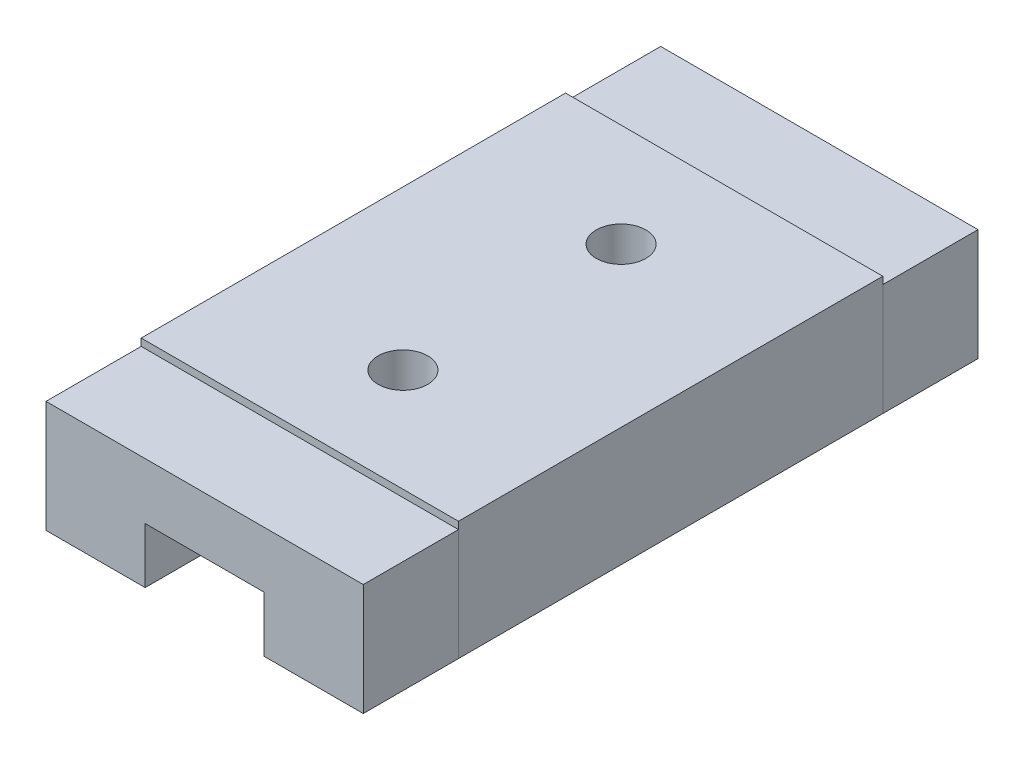
ISO-10303-21;
HEADER;
FILE_DESCRIPTION(('STEP AP214'),'2;1');
FILE_NAME('part.step','',(''),(''),'','','');
FILE_SCHEMA(('AUTOMOTIVE_DESIGN { 1 0 10303 214 1 1 1 1 }'));
ENDSEC;
DATA;
#1=APPLICATION_CONTEXT('core data for automotive mechanical design processes');
#2=APPLICATION_PROTOCOL_DEFINITION('international standard','automotive_design',2000,#1);
#3=PRODUCT_CONTEXT('',#1,'mechanical');
#4=PRODUCT('Part','Part','',(#3));
#5=PRODUCT_RELATED_PRODUCT_CATEGORY('part','',(#4));
#6=PRODUCT_DEFINITION_FORMATION('','',#4);
#7=PRODUCT_DEFINITION_CONTEXT('part definition',#1,'design');
#8=PRODUCT_DEFINITION('design','',#6,#7);
#9=PRODUCT_DEFINITION_SHAPE('','',#8);
#10=(LENGTH_UNIT() NAMED_UNIT(*) SI_UNIT(.MILLI.,.METRE.));
#11=(NAMED_UNIT(*) PLANE_ANGLE_UNIT() SI_UNIT($,.RADIAN.));
#12=(NAMED_UNIT(*) SI_UNIT($,.STERADIAN.) SOLID_ANGLE_UNIT());
#13=UNCERTAINTY_MEASURE_WITH_UNIT(LENGTH_MEASURE(1.E-05),#10,'distance_accuracy_value','');
#14=(GEOMETRIC_REPRESENTATION_CONTEXT(3) GLOBAL_UNCERTAINTY_ASSIGNED_CONTEXT((#13)) GLOBAL_UNIT_ASSIGNED_CONTEXT((#10,
#11,#12)) REPRESENTATION_CONTEXT('',''));
#15=CARTESIAN_POINT('',(0.,0.,0.));
#16=DIRECTION('',(0.,0.,1.));
#17=DIRECTION('',(1.,0.,0.));
#18=AXIS2_PLACEMENT_3D('',#15,#16,#17);
#19=CARTESIAN_POINT('',(-4.,-1.5,13.1));
#20=DIRECTION('',(1.,0.,0.));
#21=DIRECTION('',(0.,1.,0.));
#22=AXIS2_PLACEMENT_3D('',#19,#20,#21);
#23=PLANE('',#22);
#24=DIRECTION('',(0.,-1.,0.));
#25=VECTOR('',#24,1.);
#26=CARTESIAN_POINT('',(-4.,-1.5,10.7));
#27=LINE('',#26,#25);
#28=CARTESIAN_POINT('',(-4.,1.31787640624204,10.7));
#29=VERTEX_POINT('',#28);
#30=CARTESIAN_POINT('',(-4.,-1.5,10.7));
#31=VERTEX_POINT('',#30);
#32=EDGE_CURVE('E150',#29,#31,#27,.T.);
#33=ORIENTED_EDGE('',*,*,#32,.T.);
#34=DIRECTION('',(0.,0.,-1.));
#35=VECTOR('',#34,1.);
#36=CARTESIAN_POINT('',(-4.,-1.5,13.1));
#37=LINE('',#36,#35);
#38=CARTESIAN_POINT('',(-4.,-1.5,13.1));
#39=VERTEX_POINT('',#38);
#40=EDGE_CURVE('E12',#39,#31,#37,.T.);
#41=ORIENTED_EDGE('',*,*,#40,.F.);
#42=DIRECTION('',(0.,-1.,0.));
#43=VECTOR('',#42,1.);
#44=CARTESIAN_POINT('',(-4.,-1.5,13.1));
#45=LINE('',#44,#43);
#46=CARTESIAN_POINT('',(-4.,1.31787640624204,13.1));
#47=VERTEX_POINT('',#46);
#48=EDGE_CURVE('E164',#47,#39,#45,.T.);
#49=ORIENTED_EDGE('',*,*,#48,.F.);
#50=DIRECTION('',(0.,0.,-1.));
#51=VECTOR('',#50,1.);
#52=CARTESIAN_POINT('',(-4.,1.31787640624204,13.1));
#53=LINE('',#52,#51);
#54=EDGE_CURVE('E146',#47,#29,#53,.T.);
#55=ORIENTED_EDGE('',*,*,#54,.T.);
#56=EDGE_LOOP('',(#33,#41,#49,#55));
#57=FACE_BOUND('',#56,.T.);
#58=ADVANCED_FACE('F54',(#57),#23,.F.);
#59=CARTESIAN_POINT('',(-1.5,-1.5,13.1));
#60=DIRECTION('',(0.,1.,0.));
#61=DIRECTION('',(0.,0.,1.));
#62=AXIS2_PLACEMENT_3D('',#59,#60,#61);
#63=PLANE('',#62);
#64=DIRECTION('',(1.,0.,0.));
#65=VECTOR('',#64,1.);
#66=CARTESIAN_POINT('',(-1.5,-1.5,10.7));
#67=LINE('',#66,#65);
#68=CARTESIAN_POINT('',(-1.5,-1.5,10.7));
#69=VERTEX_POINT('',#68);
#70=EDGE_CURVE('E153',#31,#69,#67,.T.);
#71=ORIENTED_EDGE('',*,*,#70,.T.);
#72=DIRECTION('',(0.,0.,-1.));
#73=VECTOR('',#72,1.);
#74=CARTESIAN_POINT('',(-1.5,-1.5,13.1));
#75=LINE('',#74,#73);
#76=CARTESIAN_POINT('',(-1.5,-1.5,13.1));
#77=VERTEX_POINT('',#76);
#78=EDGE_CURVE('E62',#77,#69,#75,.T.);
#79=ORIENTED_EDGE('',*,*,#78,.F.);
#80=DIRECTION('',(1.,0.,0.));
#81=VECTOR('',#80,1.);
#82=CARTESIAN_POINT('',(-1.5,-1.5,13.1));
#83=LINE('',#82,#81);
#84=EDGE_CURVE('E113',#39,#77,#83,.T.);
#85=ORIENTED_EDGE('',*,*,#84,.F.);
#86=ORIENTED_EDGE('',*,*,#40,.T.);
#87=EDGE_LOOP('',(#71,#79,#85,#86));
#88=FACE_BOUND('',#87,.T.);
#89=ADVANCED_FACE('F199',(#88),#63,.F.);
#90=CARTESIAN_POINT('',(-1.5,-0.1,13.1));
#91=DIRECTION('',(-1.,0.,0.));
#92=DIRECTION('',(0.,0.,1.));
#93=AXIS2_PLACEMENT_3D('',#90,#91,#92);
#94=PLANE('',#93);
#95=DIRECTION('',(0.,1.,0.));
#96=VECTOR('',#95,1.);
#97=CARTESIAN_POINT('',(-1.5,-0.1,10.7));
#98=LINE('',#97,#96);
#99=CARTESIAN_POINT('',(-1.5,-0.1,10.7));
#100=VERTEX_POINT('',#99);
#101=EDGE_CURVE('E155',#69,#100,#98,.T.);
#102=ORIENTED_EDGE('',*,*,#101,.T.);
#103=DIRECTION('',(0.,0.,-1.));
#104=VECTOR('',#103,1.);
#105=CARTESIAN_POINT('',(-1.5,-0.1,13.1));
#106=LINE('',#105,#104);
#107=CARTESIAN_POINT('',(-1.5,-0.1,13.1));
#108=VERTEX_POINT('',#107);
#109=EDGE_CURVE('E171',#108,#100,#106,.T.);
#110=ORIENTED_EDGE('',*,*,#109,.F.);
#111=DIRECTION('',(0.,1.,0.));
#112=VECTOR('',#111,1.);
#113=CARTESIAN_POINT('',(-1.5,-0.1,13.1));
#114=LINE('',#113,#112);
#115=EDGE_CURVE('E179',#77,#108,#114,.T.);
#116=ORIENTED_EDGE('',*,*,#115,.F.);
#117=ORIENTED_EDGE('',*,*,#78,.T.);
#118=EDGE_LOOP('',(#102,#110,#116,#117));
#119=FACE_BOUND('',#118,.T.);
#120=ADVANCED_FACE('F177',(#119),#94,.F.);
#121=CARTESIAN_POINT('',(1.5,-0.1,13.1));
#122=DIRECTION('',(0.,1.,0.));
#123=DIRECTION('',(0.,0.,1.));
#124=AXIS2_PLACEMENT_3D('',#121,#122,#123);
#125=PLANE('',#124);
#126=DIRECTION('',(1.,0.,0.));
#127=VECTOR('',#126,1.);
#128=CARTESIAN_POINT('',(1.5,-0.1,10.7));
#129=LINE('',#128,#127);
#130=CARTESIAN_POINT('',(1.5,-0.1,10.7));
#131=VERTEX_POINT('',#130);
#132=EDGE_CURVE('E157',#100,#131,#129,.T.);
#133=ORIENTED_EDGE('',*,*,#132,.T.);
#134=DIRECTION('',(0.,0.,-1.));
#135=VECTOR('',#134,1.);
#136=CARTESIAN_POINT('',(1.5,-0.1,13.1));
#137=LINE('',#136,#135);
#138=CARTESIAN_POINT('',(1.5,-0.1,13.1));
#139=VERTEX_POINT('',#138);
#140=EDGE_CURVE('E168',#139,#131,#137,.T.);
#141=ORIENTED_EDGE('',*,*,#140,.F.);
#142=DIRECTION('',(1.,0.,0.));
#143=VECTOR('',#142,1.);
#144=CARTESIAN_POINT('',(1.5,-0.1,13.1));
#145=LINE('',#144,#143);
#146=EDGE_CURVE('E191',#108,#139,#145,.T.);
#147=ORIENTED_EDGE('',*,*,#146,.F.);
#148=ORIENTED_EDGE('',*,*,#109,.T.);
#149=EDGE_LOOP('',(#133,#141,#147,#148));
#150=FACE_BOUND('',#149,.T.);
#151=ADVANCED_FACE('F187',(#150),#125,.F.);
#152=CARTESIAN_POINT('',(1.5,-1.5,13.1));
#153=DIRECTION('',(1.,0.,0.));
#154=DIRECTION('',(0.,0.,-1.));
#155=AXIS2_PLACEMENT_3D('',#152,#153,#154);
#156=PLANE('',#155);
#157=DIRECTION('',(0.,-1.,0.));
#158=VECTOR('',#157,1.);
#159=CARTESIAN_POINT('',(1.5,-1.5,10.7));
#160=LINE('',#159,#158);
#161=CARTESIAN_POINT('',(1.5,-1.5,10.7));
#162=VERTEX_POINT('',#161);
#163=EDGE_CURVE('E159',#131,#162,#160,.T.);
#164=ORIENTED_EDGE('',*,*,#163,.T.);
#165=DIRECTION('',(0.,0.,-1.));
#166=VECTOR('',#165,1.);
#167=CARTESIAN_POINT('',(1.5,-1.5,13.1));
#168=LINE('',#167,#166);
#169=CARTESIAN_POINT('',(1.5,-1.5,13.1));
#170=VERTEX_POINT('',#169);
#171=EDGE_CURVE('E141',#170,#162,#168,.T.);
#172=ORIENTED_EDGE('',*,*,#171,.F.);
#173=DIRECTION('',(0.,-1.,0.));
#174=VECTOR('',#173,1.);
#175=CARTESIAN_POINT('',(1.5,-1.5,13.1));
#176=LINE('',#175,#174);
#177=EDGE_CURVE('E132',#139,#170,#176,.T.);
#178=ORIENTED_EDGE('',*,*,#177,.F.);
#179=ORIENTED_EDGE('',*,*,#140,.T.);
#180=EDGE_LOOP('',(#164,#172,#178,#179));
#181=FACE_BOUND('',#180,.T.);
#182=ADVANCED_FACE('F190',(#181),#156,.F.);
#183=CARTESIAN_POINT('',(4.,-1.5,13.1));
#184=DIRECTION('',(0.,1.,0.));
#185=DIRECTION('',(0.,0.,1.));
#186=AXIS2_PLACEMENT_3D('',#183,#184,#185);
#187=PLANE('',#186);
#188=DIRECTION('',(1.,0.,0.));
#189=VECTOR('',#188,1.);
#190=CARTESIAN_POINT('',(4.,-1.5,10.7));
#191=LINE('',#190,#189);
#192=CARTESIAN_POINT('',(4.,-1.5,10.7));
#193=VERTEX_POINT('',#192);
#194=EDGE_CURVE('E140',#162,#193,#191,.T.);
#195=ORIENTED_EDGE('',*,*,#194,.T.);
#196=DIRECTION('',(0.,0.,-1.));
#197=VECTOR('',#196,1.);
#198=CARTESIAN_POINT('',(4.,-1.5,13.1));
#199=LINE('',#198,#197);
#200=CARTESIAN_POINT('',(4.,-1.5,13.1));
#201=VERTEX_POINT('',#200);
#202=EDGE_CURVE('E137',#201,#193,#199,.T.);
#203=ORIENTED_EDGE('',*,*,#202,.F.);
#204=DIRECTION('',(1.,0.,0.));
#205=VECTOR('',#204,1.);
#206=CARTESIAN_POINT('',(4.,-1.5,13.1));
#207=LINE('',#206,#205);
#208=EDGE_CURVE('E126',#170,#201,#207,.T.);
#209=ORIENTED_EDGE('',*,*,#208,.F.);
#210=ORIENTED_EDGE('',*,*,#171,.T.);
#211=EDGE_LOOP('',(#195,#203,#209,#210));
#212=FACE_BOUND('',#211,.T.);
#213=ADVANCED_FACE('F138',(#212),#187,.F.);
#214=CARTESIAN_POINT('',(4.,1.31787640624204,13.1));
#215=DIRECTION('',(-1.,0.,0.));
#216=DIRECTION('',(0.,-1.,0.));
#217=AXIS2_PLACEMENT_3D('',#214,#215,#216);
#218=PLANE('',#217);
#219=DIRECTION('',(0.,1.,0.));
#220=VECTOR('',#219,1.);
#221=CARTESIAN_POINT('',(4.,1.31787640624204,10.7));
#222=LINE('',#221,#220);
#223=CARTESIAN_POINT('',(4.,1.31787640624204,10.7));
#224=VERTEX_POINT('',#223);
#225=EDGE_CURVE('E99',#193,#224,#222,.T.);
#226=ORIENTED_EDGE('',*,*,#225,.T.);
#227=DIRECTION('',(0.,0.,-1.));
#228=VECTOR('',#227,1.);
#229=CARTESIAN_POINT('',(4.,1.31787640624204,13.1));
#230=LINE('',#229,#228);
#231=CARTESIAN_POINT('',(4.,1.31787640624204,13.1));
#232=VERTEX_POINT('',#231);
#233=EDGE_CURVE('E142',#232,#224,#230,.T.);
#234=ORIENTED_EDGE('',*,*,#233,.F.);
#235=DIRECTION('',(0.,1.,0.));
#236=VECTOR('',#235,1.);
#237=CARTESIAN_POINT('',(4.,1.31787640624204,13.1));
#238=LINE('',#237,#236);
#239=EDGE_CURVE('E130',#201,#232,#238,.T.);
#240=ORIENTED_EDGE('',*,*,#239,.F.);
#241=ORIENTED_EDGE('',*,*,#202,.T.);
#242=EDGE_LOOP('',(#226,#234,#240,#241));
#243=FACE_BOUND('',#242,.T.);
#244=ADVANCED_FACE('F144',(#243),#218,.F.);
#245=CARTESIAN_POINT('',(-4.,1.31787640624204,13.1));
#246=DIRECTION('',(0.,-1.,0.));
#247=DIRECTION('',(0.,0.,-1.));
#248=AXIS2_PLACEMENT_3D('',#245,#246,#247);
#249=PLANE('',#248);
#250=DIRECTION('',(-1.,0.,0.));
#251=VECTOR('',#250,1.);
#252=CARTESIAN_POINT('',(-4.,1.31787640624204,10.7));
#253=LINE('',#252,#251);
#254=EDGE_CURVE('E105',#224,#29,#253,.T.);
#255=ORIENTED_EDGE('',*,*,#254,.T.);
#256=ORIENTED_EDGE('',*,*,#54,.F.);
#257=DIRECTION('',(-1.,0.,0.));
#258=VECTOR('',#257,1.);
#259=CARTESIAN_POINT('',(-4.,1.31787640624204,13.1));
#260=LINE('',#259,#258);
#261=EDGE_CURVE('E70',#232,#47,#260,.T.);
#262=ORIENTED_EDGE('',*,*,#261,.F.);
#263=ORIENTED_EDGE('',*,*,#233,.T.);
#264=EDGE_LOOP('',(#255,#256,#262,#263));
#265=FACE_BOUND('',#264,.T.);
#266=ADVANCED_FACE('F215',(#265),#249,.F.);
#267=CARTESIAN_POINT('',(0.,0.,13.1));
#268=DIRECTION('',(0.,0.,-1.));
#269=DIRECTION('',(-1.,0.,0.));
#270=AXIS2_PLACEMENT_3D('',#267,#268,#269);
#271=PLANE('',#270);
#272=ORIENTED_EDGE('',*,*,#48,.T.);
#273=ORIENTED_EDGE('',*,*,#84,.T.);
#274=ORIENTED_EDGE('',*,*,#115,.T.);
#275=ORIENTED_EDGE('',*,*,#146,.T.);
#276=ORIENTED_EDGE('',*,*,#177,.T.);
#277=ORIENTED_EDGE('',*,*,#208,.T.);
#278=ORIENTED_EDGE('',*,*,#239,.T.);
#279=ORIENTED_EDGE('',*,*,#261,.T.);
#280=EDGE_LOOP('',(#272,#273,#274,#275,#276,#277,#278,#279));
#281=FACE_BOUND('',#280,.T.);
#282=ADVANCED_FACE('F128',(#281),#271,.F.);
#283=CARTESIAN_POINT('',(0.,0.,10.7));
#284=DIRECTION('',(0.,0.,-1.));
#285=DIRECTION('',(-1.,0.,0.));
#286=AXIS2_PLACEMENT_3D('',#283,#284,#285);
#287=PLANE('',#286);
#288=ORIENTED_EDGE('',*,*,#32,.F.);
#289=ORIENTED_EDGE('',*,*,#254,.F.);
#290=ORIENTED_EDGE('',*,*,#225,.F.);
#291=ORIENTED_EDGE('',*,*,#194,.F.);
#292=ORIENTED_EDGE('',*,*,#163,.F.);
#293=ORIENTED_EDGE('',*,*,#132,.F.);
#294=ORIENTED_EDGE('',*,*,#101,.F.);
#295=ORIENTED_EDGE('',*,*,#70,.F.);
#296=EDGE_LOOP('',(#288,#289,#290,#291,#292,#293,#294,#295));
#297=FACE_BOUND('',#296,.T.);
#298=ADVANCED_FACE('F183',(#297),#287,.T.);
#299=CLOSED_SHELL('',(#58,#89,#120,#151,#182,#213,#244,#266,#282,#298));
#300=MANIFOLD_SOLID_BREP('B2',#299);
#301=CARTESIAN_POINT('',(4.,-1.5,-2.4));
#302=DIRECTION('',(-1.,0.,0.));
#303=DIRECTION('',(0.,0.,1.));
#304=AXIS2_PLACEMENT_3D('',#301,#302,#303);
#305=PLANE('',#304);
#306=DIRECTION('',(0.,-1.,0.));
#307=VECTOR('',#306,1.);
#308=CARTESIAN_POINT('',(4.,-1.5,0.));
#309=LINE('',#308,#307);
#310=CARTESIAN_POINT('',(4.,1.31787640624204,0.));
#311=VERTEX_POINT('',#310);
#312=CARTESIAN_POINT('',(4.,-1.5,0.));
#313=VERTEX_POINT('',#312);
#314=EDGE_CURVE('E387',#311,#313,#309,.T.);
#315=ORIENTED_EDGE('',*,*,#314,.T.);
#316=DIRECTION('',(0.,0.,1.));
#317=VECTOR('',#316,1.);
#318=CARTESIAN_POINT('',(4.,-1.5,-2.4));
#319=LINE('',#318,#317);
#320=CARTESIAN_POINT('',(4.,-1.5,-2.4));
#321=VERTEX_POINT('',#320);
#322=EDGE_CURVE('E52',#321,#313,#319,.T.);
#323=ORIENTED_EDGE('',*,*,#322,.F.);
#324=DIRECTION('',(0.,-1.,0.));
#325=VECTOR('',#324,1.);
#326=CARTESIAN_POINT('',(4.,-1.5,-2.4));
#327=LINE('',#326,#325);
#328=CARTESIAN_POINT('',(4.,1.31787640624204,-2.4));
#329=VERTEX_POINT('',#328);
#330=EDGE_CURVE('E401',#329,#321,#327,.T.);
#331=ORIENTED_EDGE('',*,*,#330,.F.);
#332=DIRECTION('',(0.,0.,1.));
#333=VECTOR('',#332,1.);
#334=CARTESIAN_POINT('',(4.,1.31787640624204,-2.4));
#335=LINE('',#334,#333);
#336=EDGE_CURVE('E383',#329,#311,#335,.T.);
#337=ORIENTED_EDGE('',*,*,#336,.T.);
#338=EDGE_LOOP('',(#315,#323,#331,#337));
#339=FACE_BOUND('',#338,.T.);
#340=ADVANCED_FACE('F291',(#339),#305,.F.);
#341=CARTESIAN_POINT('',(1.5,-1.5,-2.4));
#342=DIRECTION('',(0.,1.,0.));
#343=DIRECTION('',(0.,0.,1.));
#344=AXIS2_PLACEMENT_3D('',#341,#342,#343);
#345=PLANE('',#344);
#346=DIRECTION('',(-1.,0.,0.));
#347=VECTOR('',#346,1.);
#348=CARTESIAN_POINT('',(1.5,-1.5,0.));
#349=LINE('',#348,#347);
#350=CARTESIAN_POINT('',(1.5,-1.5,0.));
#351=VERTEX_POINT('',#350);
#352=EDGE_CURVE('E390',#313,#351,#349,.T.);
#353=ORIENTED_EDGE('',*,*,#352,.T.);
#354=DIRECTION('',(0.,0.,1.));
#355=VECTOR('',#354,1.);
#356=CARTESIAN_POINT('',(1.5,-1.5,-2.4));
#357=LINE('',#356,#355);
#358=CARTESIAN_POINT('',(1.5,-1.5,-2.4));
#359=VERTEX_POINT('',#358);
#360=EDGE_CURVE('E299',#359,#351,#357,.T.);
#361=ORIENTED_EDGE('',*,*,#360,.F.);
#362=DIRECTION('',(-1.,0.,0.));
#363=VECTOR('',#362,1.);
#364=CARTESIAN_POINT('',(1.5,-1.5,-2.4));
#365=LINE('',#364,#363);
#366=EDGE_CURVE('E350',#321,#359,#365,.T.);
#367=ORIENTED_EDGE('',*,*,#366,.F.);
#368=ORIENTED_EDGE('',*,*,#322,.T.);
#369=EDGE_LOOP('',(#353,#361,#367,#368));
#370=FACE_BOUND('',#369,.T.);
#371=ADVANCED_FACE('F436',(#370),#345,.F.);
#372=CARTESIAN_POINT('',(1.5,-0.1,-2.4));
#373=DIRECTION('',(1.,0.,0.));
#374=DIRECTION('',(0.,0.,-1.));
#375=AXIS2_PLACEMENT_3D('',#372,#373,#374);
#376=PLANE('',#375);
#377=DIRECTION('',(0.,1.,0.));
#378=VECTOR('',#377,1.);
#379=CARTESIAN_POINT('',(1.5,-0.1,0.));
#380=LINE('',#379,#378);
#381=CARTESIAN_POINT('',(1.5,-0.1,0.));
#382=VERTEX_POINT('',#381);
#383=EDGE_CURVE('E392',#351,#382,#380,.T.);
#384=ORIENTED_EDGE('',*,*,#383,.T.);
#385=DIRECTION('',(0.,0.,1.));
#386=VECTOR('',#385,1.);
#387=CARTESIAN_POINT('',(1.5,-0.1,-2.4));
#388=LINE('',#387,#386);
#389=CARTESIAN_POINT('',(1.5,-0.1,-2.4));
#390=VERTEX_POINT('',#389);
#391=EDGE_CURVE('E408',#390,#382,#388,.T.);
#392=ORIENTED_EDGE('',*,*,#391,.F.);
#393=DIRECTION('',(0.,1.,0.));
#394=VECTOR('',#393,1.);
#395=CARTESIAN_POINT('',(1.5,-0.1,-2.4));
#396=LINE('',#395,#394);
#397=EDGE_CURVE('E416',#359,#390,#396,.T.);
#398=ORIENTED_EDGE('',*,*,#397,.F.);
#399=ORIENTED_EDGE('',*,*,#360,.T.);
#400=EDGE_LOOP('',(#384,#392,#398,#399));
#401=FACE_BOUND('',#400,.T.);
#402=ADVANCED_FACE('F414',(#401),#376,.F.);
#403=CARTESIAN_POINT('',(-1.5,-0.1,-2.4));
#404=DIRECTION('',(0.,1.,0.));
#405=DIRECTION('',(0.,0.,1.));
#406=AXIS2_PLACEMENT_3D('',#403,#404,#405);
#407=PLANE('',#406);
#408=DIRECTION('',(-1.,0.,0.));
#409=VECTOR('',#408,1.);
#410=CARTESIAN_POINT('',(-1.5,-0.1,0.));
#411=LINE('',#410,#409);
#412=CARTESIAN_POINT('',(-1.5,-0.1,0.));
#413=VERTEX_POINT('',#412);
#414=EDGE_CURVE('E394',#382,#413,#411,.T.);
#415=ORIENTED_EDGE('',*,*,#414,.T.);
#416=DIRECTION('',(0.,0.,1.));
#417=VECTOR('',#416,1.);
#418=CARTESIAN_POINT('',(-1.5,-0.1,-2.4));
#419=LINE('',#418,#417);
#420=CARTESIAN_POINT('',(-1.5,-0.1,-2.4));
#421=VERTEX_POINT('',#420);
#422=EDGE_CURVE('E405',#421,#413,#419,.T.);
#423=ORIENTED_EDGE('',*,*,#422,.F.);
#424=DIRECTION('',(-1.,0.,0.));
#425=VECTOR('',#424,1.);
#426=CARTESIAN_POINT('',(-1.5,-0.1,-2.4));
#427=LINE('',#426,#425);
#428=EDGE_CURVE('E428',#390,#421,#427,.T.);
#429=ORIENTED_EDGE('',*,*,#428,.F.);
#430=ORIENTED_EDGE('',*,*,#391,.T.);
#431=EDGE_LOOP('',(#415,#423,#429,#430));
#432=FACE_BOUND('',#431,.T.);
#433=ADVANCED_FACE('F424',(#432),#407,.F.);
#434=CARTESIAN_POINT('',(-1.5,-1.5,-2.4));
#435=DIRECTION('',(-1.,0.,0.));
#436=DIRECTION('',(0.,0.,1.));
#437=AXIS2_PLACEMENT_3D('',#434,#435,#436);
#438=PLANE('',#437);
#439=DIRECTION('',(0.,-1.,0.));
#440=VECTOR('',#439,1.);
#441=CARTESIAN_POINT('',(-1.5,-1.5,0.));
#442=LINE('',#441,#440);
#443=CARTESIAN_POINT('',(-1.5,-1.5,0.));
#444=VERTEX_POINT('',#443);
#445=EDGE_CURVE('E396',#413,#444,#442,.T.);
#446=ORIENTED_EDGE('',*,*,#445,.T.);
#447=DIRECTION('',(0.,0.,1.));
#448=VECTOR('',#447,1.);
#449=CARTESIAN_POINT('',(-1.5,-1.5,-2.4));
#450=LINE('',#449,#448);
#451=CARTESIAN_POINT('',(-1.5,-1.5,-2.4));
#452=VERTEX_POINT('',#451);
#453=EDGE_CURVE('E378',#452,#444,#450,.T.);
#454=ORIENTED_EDGE('',*,*,#453,.F.);
#455=DIRECTION('',(0.,-1.,0.));
#456=VECTOR('',#455,1.);
#457=CARTESIAN_POINT('',(-1.5,-1.5,-2.4));
#458=LINE('',#457,#456);
#459=EDGE_CURVE('E369',#421,#452,#458,.T.);
#460=ORIENTED_EDGE('',*,*,#459,.F.);
#461=ORIENTED_EDGE('',*,*,#422,.T.);
#462=EDGE_LOOP('',(#446,#454,#460,#461));
#463=FACE_BOUND('',#462,.T.);
#464=ADVANCED_FACE('F427',(#463),#438,.F.);
#465=CARTESIAN_POINT('',(-4.,-1.5,-2.4));
#466=DIRECTION('',(0.,1.,0.));
#467=DIRECTION('',(0.,0.,1.));
#468=AXIS2_PLACEMENT_3D('',#465,#466,#467);
#469=PLANE('',#468);
#470=DIRECTION('',(-1.,0.,0.));
#471=VECTOR('',#470,1.);
#472=CARTESIAN_POINT('',(-4.,-1.5,0.));
#473=LINE('',#472,#471);
#474=CARTESIAN_POINT('',(-4.,-1.5,0.));
#475=VERTEX_POINT('',#474);
#476=EDGE_CURVE('E377',#444,#475,#473,.T.);
#477=ORIENTED_EDGE('',*,*,#476,.T.);
#478=DIRECTION('',(0.,0.,1.));
#479=VECTOR('',#478,1.);
#480=CARTESIAN_POINT('',(-4.,-1.5,-2.4));
#481=LINE('',#480,#479);
#482=CARTESIAN_POINT('',(-4.,-1.5,-2.4));
#483=VERTEX_POINT('',#482);
#484=EDGE_CURVE('E374',#483,#475,#481,.T.);
#485=ORIENTED_EDGE('',*,*,#484,.F.);
#486=DIRECTION('',(-1.,0.,0.));
#487=VECTOR('',#486,1.);
#488=CARTESIAN_POINT('',(-4.,-1.5,-2.4));
#489=LINE('',#488,#487);
#490=EDGE_CURVE('E363',#452,#483,#489,.T.);
#491=ORIENTED_EDGE('',*,*,#490,.F.);
#492=ORIENTED_EDGE('',*,*,#453,.T.);
#493=EDGE_LOOP('',(#477,#485,#491,#492));
#494=FACE_BOUND('',#493,.T.);
#495=ADVANCED_FACE('F375',(#494),#469,.F.);
#496=CARTESIAN_POINT('',(-4.,1.31787640624204,-2.4));
#497=DIRECTION('',(1.,0.,0.));
#498=DIRECTION('',(0.,1.,0.));
#499=AXIS2_PLACEMENT_3D('',#496,#497,#498);
#500=PLANE('',#499);
#501=DIRECTION('',(0.,1.,0.));
#502=VECTOR('',#501,1.);
#503=CARTESIAN_POINT('',(-4.,1.31787640624204,0.));
#504=LINE('',#503,#502);
#505=CARTESIAN_POINT('',(-4.,1.31787640624204,0.));
#506=VERTEX_POINT('',#505);
#507=EDGE_CURVE('E336',#475,#506,#504,.T.);
#508=ORIENTED_EDGE('',*,*,#507,.T.);
#509=DIRECTION('',(0.,0.,1.));
#510=VECTOR('',#509,1.);
#511=CARTESIAN_POINT('',(-4.,1.31787640624204,-2.4));
#512=LINE('',#511,#510);
#513=CARTESIAN_POINT('',(-4.,1.31787640624204,-2.4));
#514=VERTEX_POINT('',#513);
#515=EDGE_CURVE('E379',#514,#506,#512,.T.);
#516=ORIENTED_EDGE('',*,*,#515,.F.);
#517=DIRECTION('',(0.,1.,0.));
#518=VECTOR('',#517,1.);
#519=CARTESIAN_POINT('',(-4.,1.31787640624204,-2.4));
#520=LINE('',#519,#518);
#521=EDGE_CURVE('E367',#483,#514,#520,.T.);
#522=ORIENTED_EDGE('',*,*,#521,.F.);
#523=ORIENTED_EDGE('',*,*,#484,.T.);
#524=EDGE_LOOP('',(#508,#516,#522,#523));
#525=FACE_BOUND('',#524,.T.);
#526=ADVANCED_FACE('F381',(#525),#500,.F.);
#527=CARTESIAN_POINT('',(4.,1.31787640624204,-2.4));
#528=DIRECTION('',(0.,-1.,0.));
#529=DIRECTION('',(0.,0.,-1.));
#530=AXIS2_PLACEMENT_3D('',#527,#528,#529);
#531=PLANE('',#530);
#532=DIRECTION('',(1.,0.,0.));
#533=VECTOR('',#532,1.);
#534=CARTESIAN_POINT('',(4.,1.31787640624204,0.));
#535=LINE('',#534,#533);
#536=EDGE_CURVE('E342',#506,#311,#535,.T.);
#537=ORIENTED_EDGE('',*,*,#536,.T.);
#538=ORIENTED_EDGE('',*,*,#336,.F.);
#539=DIRECTION('',(1.,0.,0.));
#540=VECTOR('',#539,1.);
#541=CARTESIAN_POINT('',(4.,1.31787640624204,-2.4));
#542=LINE('',#541,#540);
#543=EDGE_CURVE('E307',#514,#329,#542,.T.);
#544=ORIENTED_EDGE('',*,*,#543,.F.);
#545=ORIENTED_EDGE('',*,*,#515,.T.);
#546=EDGE_LOOP('',(#537,#538,#544,#545));
#547=FACE_BOUND('',#546,.T.);
#548=ADVANCED_FACE('F452',(#547),#531,.F.);
#549=CARTESIAN_POINT('',(0.,0.,-2.4));
#550=DIRECTION('',(0.,0.,1.));
#551=DIRECTION('',(1.,0.,0.));
#552=AXIS2_PLACEMENT_3D('',#549,#550,#551);
#553=PLANE('',#552);
#554=ORIENTED_EDGE('',*,*,#330,.T.);
#555=ORIENTED_EDGE('',*,*,#366,.T.);
#556=ORIENTED_EDGE('',*,*,#397,.T.);
#557=ORIENTED_EDGE('',*,*,#428,.T.);
#558=ORIENTED_EDGE('',*,*,#459,.T.);
#559=ORIENTED_EDGE('',*,*,#490,.T.);
#560=ORIENTED_EDGE('',*,*,#521,.T.);
#561=ORIENTED_EDGE('',*,*,#543,.T.);
#562=EDGE_LOOP('',(#554,#555,#556,#557,#558,#559,#560,#561));
#563=FACE_BOUND('',#562,.T.);
#564=ADVANCED_FACE('F365',(#563),#553,.F.);
#565=CARTESIAN_POINT('',(0.,0.,0.));
#566=DIRECTION('',(0.,0.,1.));
#567=DIRECTION('',(1.,0.,0.));
#568=AXIS2_PLACEMENT_3D('',#565,#566,#567);
#569=PLANE('',#568);
#570=ORIENTED_EDGE('',*,*,#314,.F.);
#571=ORIENTED_EDGE('',*,*,#536,.F.);
#572=ORIENTED_EDGE('',*,*,#507,.F.);
#573=ORIENTED_EDGE('',*,*,#476,.F.);
#574=ORIENTED_EDGE('',*,*,#445,.F.);
#575=ORIENTED_EDGE('',*,*,#414,.F.);
#576=ORIENTED_EDGE('',*,*,#383,.F.);
#577=ORIENTED_EDGE('',*,*,#352,.F.);
#578=EDGE_LOOP('',(#570,#571,#572,#573,#574,#575,#576,#577));
#579=FACE_BOUND('',#578,.T.);
#580=ADVANCED_FACE('F420',(#579),#569,.T.);
#581=CLOSED_SHELL('',(#340,#371,#402,#433,#464,#495,#526,#548,#564,#580));
#582=MANIFOLD_SOLID_BREP('B6',#581);
#583=CARTESIAN_POINT('',(4.,-1.5,10.7));
#584=DIRECTION('',(-1.,0.,0.));
#585=DIRECTION('',(0.,0.,1.));
#586=AXIS2_PLACEMENT_3D('',#583,#584,#585);
#587=PLANE('',#586);
#588=DIRECTION('',(0.,1.,0.));
#589=VECTOR('',#588,1.);
#590=CARTESIAN_POINT('',(4.,-1.5,0.));
#591=LINE('',#590,#589);
#592=CARTESIAN_POINT('',(4.,-1.5,0.));
#593=VERTEX_POINT('',#592);
#594=CARTESIAN_POINT('',(4.,1.5,0.));
#595=VERTEX_POINT('',#594);
#596=EDGE_CURVE('E622',#593,#595,#591,.T.);
#597=ORIENTED_EDGE('',*,*,#596,.T.);
#598=DIRECTION('',(0.,0.,-1.));
#599=VECTOR('',#598,1.);
#600=CARTESIAN_POINT('',(4.,1.5,10.7));
#601=LINE('',#600,#599);
#602=CARTESIAN_POINT('',(4.,1.5,10.7));
#603=VERTEX_POINT('',#602);
#604=EDGE_CURVE('E289',#603,#595,#601,.T.);
#605=ORIENTED_EDGE('',*,*,#604,.F.);
#606=DIRECTION('',(0.,1.,0.));
#607=VECTOR('',#606,1.);
#608=CARTESIAN_POINT('',(4.,-1.5,10.7));
#609=LINE('',#608,#607);
#610=CARTESIAN_POINT('',(4.,-1.5,10.7));
#611=VERTEX_POINT('',#610);
#612=EDGE_CURVE('E645',#611,#603,#609,.T.);
#613=ORIENTED_EDGE('',*,*,#612,.F.);
#614=DIRECTION('',(0.,0.,-1.));
#615=VECTOR('',#614,1.);
#616=CARTESIAN_POINT('',(4.,-1.5,10.7));
#617=LINE('',#616,#615);
#618=EDGE_CURVE('E618',#611,#593,#617,.T.);
#619=ORIENTED_EDGE('',*,*,#618,.T.);
#620=EDGE_LOOP('',(#597,#605,#613,#619));
#621=FACE_BOUND('',#620,.T.);
#622=ADVANCED_FACE('F519',(#621),#587,.F.);
#623=CARTESIAN_POINT('',(-4.,1.5,10.7));
#624=DIRECTION('',(0.,-1.,0.));
#625=DIRECTION('',(0.,0.,-1.));
#626=AXIS2_PLACEMENT_3D('',#623,#624,#625);
#627=PLANE('',#626);
#628=CARTESIAN_POINT('',(0.,1.5,2.6));
#629=DIRECTION('',(0.,1.,0.));
#630=DIRECTION('',(0.,0.,1.));
#631=AXIS2_PLACEMENT_3D('',#628,#629,#630);
#632=CIRCLE('',#631,0.62499999999999);
#633=CARTESIAN_POINT('',(0.,1.5,3.22499999999999));
#634=VERTEX_POINT('',#633);
#635=EDGE_CURVE('E674',#634,#634,#632,.T.);
#636=ORIENTED_EDGE('',*,*,#635,.F.);
#637=EDGE_LOOP('',(#636));
#638=FACE_BOUND('',#637,.T.);
#639=CARTESIAN_POINT('',(0.,1.5,8.1));
#640=DIRECTION('',(0.,1.,0.));
#641=DIRECTION('',(0.,0.,1.));
#642=AXIS2_PLACEMENT_3D('',#639,#640,#641);
#643=CIRCLE('',#642,0.62499999999999);
#644=CARTESIAN_POINT('',(0.,1.5,8.72499999999999));
#645=VERTEX_POINT('',#644);
#646=EDGE_CURVE('E664',#645,#645,#643,.T.);
#647=ORIENTED_EDGE('',*,*,#646,.F.);
#648=EDGE_LOOP('',(#647));
#649=FACE_BOUND('',#648,.T.);
#650=DIRECTION('',(-1.,0.,0.));
#651=VECTOR('',#650,1.);
#652=CARTESIAN_POINT('',(-4.,1.5,0.));
#653=LINE('',#652,#651);
#654=CARTESIAN_POINT('',(-4.,1.5,0.));
#655=VERTEX_POINT('',#654);
#656=EDGE_CURVE('E626',#595,#655,#653,.T.);
#657=ORIENTED_EDGE('',*,*,#656,.T.);
#658=DIRECTION('',(0.,0.,-1.));
#659=VECTOR('',#658,1.);
#660=CARTESIAN_POINT('',(-4.,1.5,10.7));
#661=LINE('',#660,#659);
#662=CARTESIAN_POINT('',(-4.,1.5,10.7));
#663=VERTEX_POINT('',#662);
#664=EDGE_CURVE('E529',#663,#655,#661,.T.);
#665=ORIENTED_EDGE('',*,*,#664,.F.);
#666=DIRECTION('',(-1.,0.,0.));
#667=VECTOR('',#666,1.);
#668=CARTESIAN_POINT('',(-4.,1.5,10.7));
#669=LINE('',#668,#667);
#670=EDGE_CURVE('E581',#603,#663,#669,.T.);
#671=ORIENTED_EDGE('',*,*,#670,.F.);
#672=ORIENTED_EDGE('',*,*,#604,.T.);
#673=EDGE_LOOP('',(#657,#665,#671,#672));
#674=FACE_BOUND('',#673,.T.);
#675=ADVANCED_FACE('F715',(#638,#649,#674),#627,.F.);
#676=CARTESIAN_POINT('',(-4.,-1.5,10.7));
#677=DIRECTION('',(1.,0.,0.));
#678=DIRECTION('',(0.,0.,-1.));
#679=AXIS2_PLACEMENT_3D('',#676,#677,#678);
#680=PLANE('',#679);
#681=DIRECTION('',(0.,-1.,0.));
#682=VECTOR('',#681,1.);
#683=CARTESIAN_POINT('',(-4.,-1.5,0.));
#684=LINE('',#683,#682);
#685=CARTESIAN_POINT('',(-4.,-1.5,0.));
#686=VERTEX_POINT('',#685);
#687=EDGE_CURVE('E630',#655,#686,#684,.T.);
#688=ORIENTED_EDGE('',*,*,#687,.T.);
#689=DIRECTION('',(0.,0.,-1.));
#690=VECTOR('',#689,1.);
#691=CARTESIAN_POINT('',(-4.,-1.5,10.7));
#692=LINE('',#691,#690);
#693=CARTESIAN_POINT('',(-4.,-1.5,10.7));
#694=VERTEX_POINT('',#693);
#695=EDGE_CURVE('E656',#694,#686,#692,.T.);
#696=ORIENTED_EDGE('',*,*,#695,.F.);
#697=DIRECTION('',(0.,-1.,0.));
#698=VECTOR('',#697,1.);
#699=CARTESIAN_POINT('',(-4.,-1.5,10.7));
#700=LINE('',#699,#698);
#701=EDGE_CURVE('E681',#663,#694,#700,.T.);
#702=ORIENTED_EDGE('',*,*,#701,.F.);
#703=ORIENTED_EDGE('',*,*,#664,.T.);
#704=EDGE_LOOP('',(#688,#696,#702,#703));
#705=FACE_BOUND('',#704,.T.);
#706=ADVANCED_FACE('F719',(#705),#680,.F.);
#707=CARTESIAN_POINT('',(-4.,-1.5,10.7));
#708=DIRECTION('',(0.,1.,0.));
#709=DIRECTION('',(0.,0.,1.));
#710=AXIS2_PLACEMENT_3D('',#707,#708,#709);
#711=PLANE('',#710);
#712=DIRECTION('',(1.,0.,0.));
#713=VECTOR('',#712,1.);
#714=CARTESIAN_POINT('',(-4.,-1.5,0.));
#715=LINE('',#714,#713);
#716=CARTESIAN_POINT('',(-1.5,-1.5,0.));
#717=VERTEX_POINT('',#716);
#718=EDGE_CURVE('E633',#686,#717,#715,.T.);
#719=ORIENTED_EDGE('',*,*,#718,.T.);
#720=DIRECTION('',(0.,0.,-1.));
#721=VECTOR('',#720,1.);
#722=CARTESIAN_POINT('',(-1.5,-1.5,10.7));
#723=LINE('',#722,#721);
#724=CARTESIAN_POINT('',(-1.5,-1.5,10.7));
#725=VERTEX_POINT('',#724);
#726=EDGE_CURVE('E652',#725,#717,#723,.T.);
#727=ORIENTED_EDGE('',*,*,#726,.F.);
#728=DIRECTION('',(1.,0.,0.));
#729=VECTOR('',#728,1.);
#730=CARTESIAN_POINT('',(-4.,-1.5,10.7));
#731=LINE('',#730,#729);
#732=EDGE_CURVE('E684',#694,#725,#731,.T.);
#733=ORIENTED_EDGE('',*,*,#732,.F.);
#734=ORIENTED_EDGE('',*,*,#695,.T.);
#735=EDGE_LOOP('',(#719,#727,#733,#734));
#736=FACE_BOUND('',#735,.T.);
#737=ADVANCED_FACE('F692',(#736),#711,.F.);
#738=CARTESIAN_POINT('',(-1.5,-1.5,10.7));
#739=DIRECTION('',(-1.,0.,0.));
#740=DIRECTION('',(0.,0.,1.));
#741=AXIS2_PLACEMENT_3D('',#738,#739,#740);
#742=PLANE('',#741);
#743=DIRECTION('',(0.,1.,0.));
#744=VECTOR('',#743,1.);
#745=CARTESIAN_POINT('',(-1.5,-1.5,0.));
#746=LINE('',#745,#744);
#747=CARTESIAN_POINT('',(-1.5,-0.1,0.));
#748=VERTEX_POINT('',#747);
#749=EDGE_CURVE('E636',#717,#748,#746,.T.);
#750=ORIENTED_EDGE('',*,*,#749,.T.);
#751=DIRECTION('',(0.,0.,-1.));
#752=VECTOR('',#751,1.);
#753=CARTESIAN_POINT('',(-1.5,-0.1,10.7));
#754=LINE('',#753,#752);
#755=CARTESIAN_POINT('',(-1.5,-0.1,10.7));
#756=VERTEX_POINT('',#755);
#757=EDGE_CURVE('E611',#756,#748,#754,.T.);
#758=ORIENTED_EDGE('',*,*,#757,.F.);
#759=DIRECTION('',(0.,1.,0.));
#760=VECTOR('',#759,1.);
#761=CARTESIAN_POINT('',(-1.5,-1.5,10.7));
#762=LINE('',#761,#760);
#763=EDGE_CURVE('E600',#725,#756,#762,.T.);
#764=ORIENTED_EDGE('',*,*,#763,.F.);
#765=ORIENTED_EDGE('',*,*,#726,.T.);
#766=EDGE_LOOP('',(#750,#758,#764,#765));
#767=FACE_BOUND('',#766,.T.);
#768=ADVANCED_FACE('F696',(#767),#742,.F.);
#769=CARTESIAN_POINT('',(-1.5,-0.1,10.7));
#770=DIRECTION('',(0.,1.,0.));
#771=DIRECTION('',(0.,0.,1.));
#772=AXIS2_PLACEMENT_3D('',#769,#770,#771);
#773=PLANE('',#772);
#774=CARTESIAN_POINT('',(0.,-0.1,2.6));
#775=DIRECTION('',(0.,1.,0.));
#776=DIRECTION('',(0.,0.,1.));
#777=AXIS2_PLACEMENT_3D('',#774,#775,#776);
#778=CIRCLE('',#777,0.624999999999995);
#779=CARTESIAN_POINT('',(0.,-0.1,3.22499999999999));
#780=VERTEX_POINT('',#779);
#781=EDGE_CURVE('E522',#780,#780,#778,.T.);
#782=ORIENTED_EDGE('',*,*,#781,.T.);
#783=EDGE_LOOP('',(#782));
#784=FACE_BOUND('',#783,.T.);
#785=CARTESIAN_POINT('',(0.,-0.1,8.1));
#786=DIRECTION('',(0.,1.,0.));
#787=DIRECTION('',(0.,0.,1.));
#788=AXIS2_PLACEMENT_3D('',#785,#786,#787);
#789=CIRCLE('',#788,0.624999999999995);
#790=CARTESIAN_POINT('',(0.,-0.1,8.72499999999999));
#791=VERTEX_POINT('',#790);
#792=EDGE_CURVE('E627',#791,#791,#789,.T.);
#793=ORIENTED_EDGE('',*,*,#792,.T.);
#794=EDGE_LOOP('',(#793));
#795=FACE_BOUND('',#794,.T.);
#796=DIRECTION('',(1.,0.,0.));
#797=VECTOR('',#796,1.);
#798=CARTESIAN_POINT('',(-1.5,-0.1,0.));
#799=LINE('',#798,#797);
#800=CARTESIAN_POINT('',(1.5,-0.1,0.));
#801=VERTEX_POINT('',#800);
#802=EDGE_CURVE('E609',#748,#801,#799,.T.);
#803=ORIENTED_EDGE('',*,*,#802,.T.);
#804=DIRECTION('',(0.,0.,-1.));
#805=VECTOR('',#804,1.);
#806=CARTESIAN_POINT('',(1.5,-0.1,10.7));
#807=LINE('',#806,#805);
#808=CARTESIAN_POINT('',(1.5,-0.1,10.7));
#809=VERTEX_POINT('',#808);
#810=EDGE_CURVE('E606',#809,#801,#807,.T.);
#811=ORIENTED_EDGE('',*,*,#810,.F.);
#812=DIRECTION('',(1.,0.,0.));
#813=VECTOR('',#812,1.);
#814=CARTESIAN_POINT('',(-1.5,-0.1,10.7));
#815=LINE('',#814,#813);
#816=EDGE_CURVE('E594',#756,#809,#815,.T.);
#817=ORIENTED_EDGE('',*,*,#816,.F.);
#818=ORIENTED_EDGE('',*,*,#757,.T.);
#819=EDGE_LOOP('',(#803,#811,#817,#818));
#820=FACE_BOUND('',#819,.T.);
#821=ADVANCED_FACE('F607',(#784,#795,#820),#773,.F.);
#822=CARTESIAN_POINT('',(1.5,-0.1,10.7));
#823=DIRECTION('',(1.,0.,0.));
#824=DIRECTION('',(0.,0.,-1.));
#825=AXIS2_PLACEMENT_3D('',#822,#823,#824);
#826=PLANE('',#825);
#827=DIRECTION('',(0.,-1.,0.));
#828=VECTOR('',#827,1.);
#829=CARTESIAN_POINT('',(1.5,-0.1,0.));
#830=LINE('',#829,#828);
#831=CARTESIAN_POINT('',(1.5,-1.5,0.));
#832=VERTEX_POINT('',#831);
#833=EDGE_CURVE('E567',#801,#832,#830,.T.);
#834=ORIENTED_EDGE('',*,*,#833,.T.);
#835=DIRECTION('',(0.,0.,-1.));
#836=VECTOR('',#835,1.);
#837=CARTESIAN_POINT('',(1.5,-1.5,10.7));
#838=LINE('',#837,#836);
#839=CARTESIAN_POINT('',(1.5,-1.5,10.7));
#840=VERTEX_POINT('',#839);
#841=EDGE_CURVE('E612',#840,#832,#838,.T.);
#842=ORIENTED_EDGE('',*,*,#841,.F.);
#843=DIRECTION('',(0.,-1.,0.));
#844=VECTOR('',#843,1.);
#845=CARTESIAN_POINT('',(1.5,-0.1,10.7));
#846=LINE('',#845,#844);
#847=EDGE_CURVE('E598',#809,#840,#846,.T.);
#848=ORIENTED_EDGE('',*,*,#847,.F.);
#849=ORIENTED_EDGE('',*,*,#810,.T.);
#850=EDGE_LOOP('',(#834,#842,#848,#849));
#851=FACE_BOUND('',#850,.T.);
#852=ADVANCED_FACE('F614',(#851),#826,.F.);
#853=CARTESIAN_POINT('',(1.5,-1.5,10.7));
#854=DIRECTION('',(0.,1.,0.));
#855=DIRECTION('',(0.,0.,1.));
#856=AXIS2_PLACEMENT_3D('',#853,#854,#855);
#857=PLANE('',#856);
#858=DIRECTION('',(1.,0.,0.));
#859=VECTOR('',#858,1.);
#860=CARTESIAN_POINT('',(1.5,-1.5,0.));
#861=LINE('',#860,#859);
#862=EDGE_CURVE('E573',#832,#593,#861,.T.);
#863=ORIENTED_EDGE('',*,*,#862,.T.);
#864=ORIENTED_EDGE('',*,*,#618,.F.);
#865=DIRECTION('',(1.,0.,0.));
#866=VECTOR('',#865,1.);
#867=CARTESIAN_POINT('',(1.5,-1.5,10.7));
#868=LINE('',#867,#866);
#869=EDGE_CURVE('E538',#840,#611,#868,.T.);
#870=ORIENTED_EDGE('',*,*,#869,.F.);
#871=ORIENTED_EDGE('',*,*,#841,.T.);
#872=EDGE_LOOP('',(#863,#864,#870,#871));
#873=FACE_BOUND('',#872,.T.);
#874=ADVANCED_FACE('F704',(#873),#857,.F.);
#875=CARTESIAN_POINT('',(0.,0.,10.7));
#876=DIRECTION('',(0.,0.,-1.));
#877=DIRECTION('',(-1.,0.,0.));
#878=AXIS2_PLACEMENT_3D('',#875,#876,#877);
#879=PLANE('',#878);
#880=ORIENTED_EDGE('',*,*,#612,.T.);
#881=ORIENTED_EDGE('',*,*,#670,.T.);
#882=ORIENTED_EDGE('',*,*,#701,.T.);
#883=ORIENTED_EDGE('',*,*,#732,.T.);
#884=ORIENTED_EDGE('',*,*,#763,.T.);
#885=ORIENTED_EDGE('',*,*,#816,.T.);
#886=ORIENTED_EDGE('',*,*,#847,.T.);
#887=ORIENTED_EDGE('',*,*,#869,.T.);
#888=EDGE_LOOP('',(#880,#881,#882,#883,#884,#885,#886,#887));
#889=FACE_BOUND('',#888,.T.);
#890=ADVANCED_FACE('F596',(#889),#879,.F.);
#891=CARTESIAN_POINT('',(0.,0.,0.));
#892=DIRECTION('',(0.,0.,-1.));
#893=DIRECTION('',(-1.,0.,0.));
#894=AXIS2_PLACEMENT_3D('',#891,#892,#893);
#895=PLANE('',#894);
#896=ORIENTED_EDGE('',*,*,#596,.F.);
#897=ORIENTED_EDGE('',*,*,#862,.F.);
#898=ORIENTED_EDGE('',*,*,#833,.F.);
#899=ORIENTED_EDGE('',*,*,#802,.F.);
#900=ORIENTED_EDGE('',*,*,#749,.F.);
#901=ORIENTED_EDGE('',*,*,#718,.F.);
#902=ORIENTED_EDGE('',*,*,#687,.F.);
#903=ORIENTED_EDGE('',*,*,#656,.F.);
#904=EDGE_LOOP('',(#896,#897,#898,#899,#900,#901,#902,#903));
#905=FACE_BOUND('',#904,.T.);
#906=ADVANCED_FACE('F699',(#905),#895,.T.);
#907=CARTESIAN_POINT('',(0.,1.5,8.1));
#908=DIRECTION('',(0.,1.,0.));
#909=DIRECTION('',(0.,0.,1.));
#910=AXIS2_PLACEMENT_3D('',#907,#908,#909);
#911=CYLINDRICAL_SURFACE('',#910,0.624999999999995);
#912=ORIENTED_EDGE('',*,*,#646,.T.);
#913=EDGE_LOOP('',(#912));
#914=FACE_BOUND('',#913,.T.);
#915=ORIENTED_EDGE('',*,*,#792,.F.);
#916=EDGE_LOOP('',(#915));
#917=FACE_BOUND('',#916,.T.);
#918=ADVANCED_FACE('F741',(#914,#917),#911,.F.);
#919=CARTESIAN_POINT('',(0.,1.5,2.6));
#920=DIRECTION('',(0.,1.,0.));
#921=DIRECTION('',(0.,0.,1.));
#922=AXIS2_PLACEMENT_3D('',#919,#920,#921);
#923=CYLINDRICAL_SURFACE('',#922,0.624999999999995);
#924=ORIENTED_EDGE('',*,*,#635,.T.);
#925=EDGE_LOOP('',(#924));
#926=FACE_BOUND('',#925,.T.);
#927=ORIENTED_EDGE('',*,*,#781,.F.);
#928=EDGE_LOOP('',(#927));
#929=FACE_BOUND('',#928,.T.);
#930=ADVANCED_FACE('F739',(#926,#929),#923,.F.);
#931=CLOSED_SHELL('',(#622,#675,#706,#737,#768,#821,#852,#874,#890,#906,#918,#930));
#932=MANIFOLD_SOLID_BREP('B46',#931);
#933=ADVANCED_BREP_SHAPE_REPRESENTATION('',(#18,#300,#582,#932),#14);
#934=SHAPE_DEFINITION_REPRESENTATION(#9,#933);
ENDSEC;
END-ISO-10303-21;
